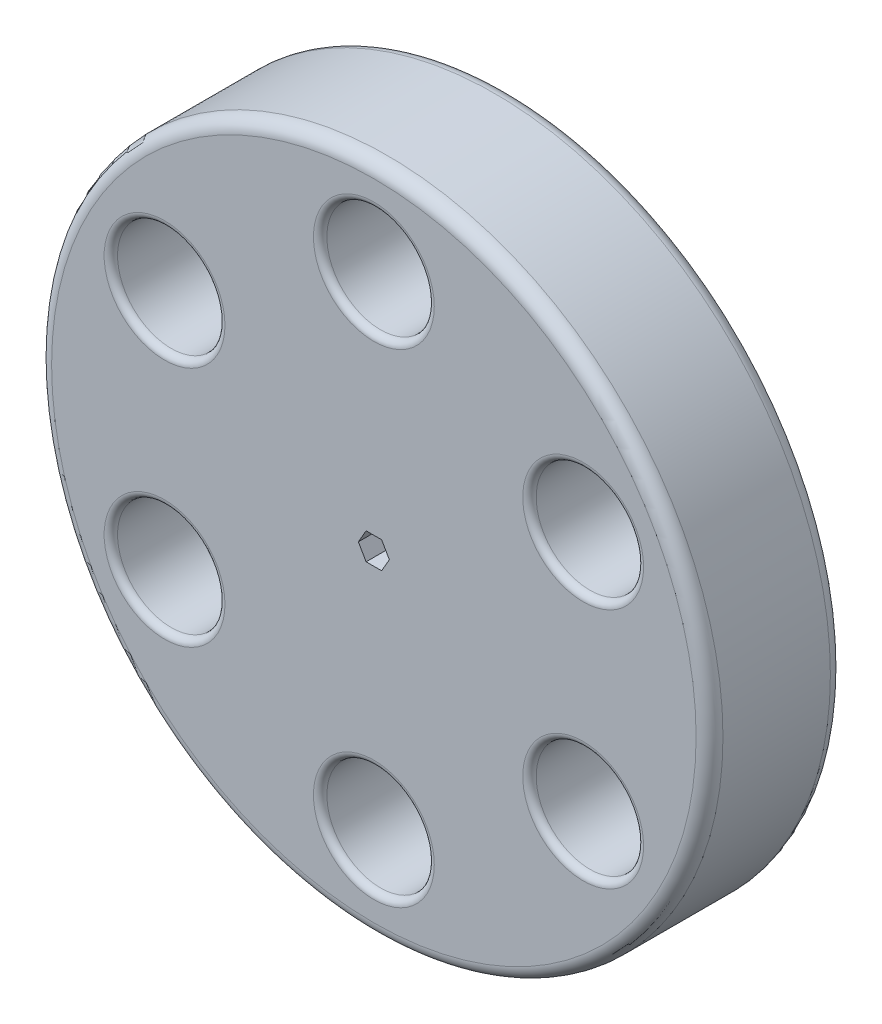
ISO-10303-21;
HEADER;
FILE_DESCRIPTION(('STEP AP214'),'2;1');
FILE_NAME('part.step','',(''),(''),'','','');
FILE_SCHEMA(('AUTOMOTIVE_DESIGN { 1 0 10303 214 1 1 1 1 }'));
ENDSEC;
DATA;
#1=APPLICATION_CONTEXT('core data for automotive mechanical design processes');
#2=APPLICATION_PROTOCOL_DEFINITION('international standard','automotive_design',2000,#1);
#3=PRODUCT_CONTEXT('',#1,'mechanical');
#4=PRODUCT('Part','Part','',(#3));
#5=PRODUCT_RELATED_PRODUCT_CATEGORY('part','',(#4));
#6=PRODUCT_DEFINITION_FORMATION('','',#4);
#7=PRODUCT_DEFINITION_CONTEXT('part definition',#1,'design');
#8=PRODUCT_DEFINITION('design','',#6,#7);
#9=PRODUCT_DEFINITION_SHAPE('','',#8);
#10=(LENGTH_UNIT() NAMED_UNIT(*) SI_UNIT(.MILLI.,.METRE.));
#11=(NAMED_UNIT(*) PLANE_ANGLE_UNIT() SI_UNIT($,.RADIAN.));
#12=(NAMED_UNIT(*) SI_UNIT($,.STERADIAN.) SOLID_ANGLE_UNIT());
#13=UNCERTAINTY_MEASURE_WITH_UNIT(LENGTH_MEASURE(1.E-05),#10,'distance_accuracy_value','');
#14=(GEOMETRIC_REPRESENTATION_CONTEXT(3) GLOBAL_UNCERTAINTY_ASSIGNED_CONTEXT((#13)) GLOBAL_UNIT_ASSIGNED_CONTEXT((#10,
#11,#12)) REPRESENTATION_CONTEXT('',''));
#15=CARTESIAN_POINT('',(0.,0.,0.));
#16=DIRECTION('',(0.,0.,1.));
#17=DIRECTION('',(1.,0.,0.));
#18=AXIS2_PLACEMENT_3D('',#15,#16,#17);
#19=CARTESIAN_POINT('',(0.,0.,10.));
#20=DIRECTION('',(0.,0.,-1.));
#21=DIRECTION('',(-1.,0.,0.));
#22=AXIS2_PLACEMENT_3D('',#19,#20,#21);
#23=CYLINDRICAL_SURFACE('',#22,25.);
#24=CARTESIAN_POINT('',(0.,0.,0.999999999999999));
#25=DIRECTION('',(0.,0.,1.));
#26=DIRECTION('',(1.,0.,0.));
#27=AXIS2_PLACEMENT_3D('',#24,#25,#26);
#28=CIRCLE('',#27,25.);
#29=CARTESIAN_POINT('',(25.,0.,0.999999999999999));
#30=VERTEX_POINT('',#29);
#31=EDGE_CURVE('E135',#30,#30,#28,.T.);
#32=ORIENTED_EDGE('',*,*,#31,.T.);
#33=EDGE_LOOP('',(#32));
#34=FACE_BOUND('',#33,.T.);
#35=CARTESIAN_POINT('',(0.,0.,9.));
#36=DIRECTION('',(0.,0.,1.));
#37=DIRECTION('',(1.,0.,0.));
#38=AXIS2_PLACEMENT_3D('',#35,#36,#37);
#39=CIRCLE('',#38,25.);
#40=CARTESIAN_POINT('',(25.,0.,9.));
#41=VERTEX_POINT('',#40);
#42=EDGE_CURVE('E131',#41,#41,#39,.F.);
#43=ORIENTED_EDGE('',*,*,#42,.T.);
#44=EDGE_LOOP('',(#43));
#45=FACE_BOUND('',#44,.T.);
#46=ADVANCED_FACE('F37',(#34,#45),#23,.T.);
#47=CARTESIAN_POINT('',(0.,0.,10.));
#48=DIRECTION('',(0.,0.,1.));
#49=DIRECTION('',(1.,0.,0.));
#50=AXIS2_PLACEMENT_3D('',#47,#48,#49);
#51=PLANE('',#50);
#52=DIRECTION('',(0.5,0.866025403784439,0.));
#53=VECTOR('',#52,1.);
#54=CARTESIAN_POINT('',(0.577350269189626,-1.,10.));
#55=LINE('',#54,#53);
#56=CARTESIAN_POINT('',(0.577350269189626,-1.,10.));
#57=VERTEX_POINT('',#56);
#58=CARTESIAN_POINT('',(1.15470053837925,0.,10.));
#59=VERTEX_POINT('',#58);
#60=EDGE_CURVE('E52',#57,#59,#55,.T.);
#61=ORIENTED_EDGE('',*,*,#60,.F.);
#62=DIRECTION('',(1.,0.,0.));
#63=VECTOR('',#62,1.);
#64=CARTESIAN_POINT('',(-0.577350269189626,-1.,10.));
#65=LINE('',#64,#63);
#66=CARTESIAN_POINT('',(-0.577350269189626,-1.,10.));
#67=VERTEX_POINT('',#66);
#68=EDGE_CURVE('E118',#67,#57,#65,.T.);
#69=ORIENTED_EDGE('',*,*,#68,.F.);
#70=DIRECTION('',(0.5,-0.866025403784438,0.));
#71=VECTOR('',#70,1.);
#72=CARTESIAN_POINT('',(-1.15470053837925,0.,10.));
#73=LINE('',#72,#71);
#74=CARTESIAN_POINT('',(-1.15470053837925,0.,10.));
#75=VERTEX_POINT('',#74);
#76=EDGE_CURVE('E112',#75,#67,#73,.T.);
#77=ORIENTED_EDGE('',*,*,#76,.F.);
#78=DIRECTION('',(-0.5,-0.866025403784439,0.));
#79=VECTOR('',#78,1.);
#80=CARTESIAN_POINT('',(-0.577350269189626,1.,10.));
#81=LINE('',#80,#79);
#82=CARTESIAN_POINT('',(-0.577350269189626,1.,10.));
#83=VERTEX_POINT('',#82);
#84=EDGE_CURVE('E110',#83,#75,#81,.T.);
#85=ORIENTED_EDGE('',*,*,#84,.F.);
#86=DIRECTION('',(-1.,0.,0.));
#87=VECTOR('',#86,1.);
#88=CARTESIAN_POINT('',(0.577350269189625,1.,10.));
#89=LINE('',#88,#87);
#90=CARTESIAN_POINT('',(0.577350269189625,1.,10.));
#91=VERTEX_POINT('',#90);
#92=EDGE_CURVE('E93',#91,#83,#89,.T.);
#93=ORIENTED_EDGE('',*,*,#92,.F.);
#94=DIRECTION('',(-0.5,0.866025403784439,0.));
#95=VECTOR('',#94,1.);
#96=CARTESIAN_POINT('',(1.15470053837925,0.,10.));
#97=LINE('',#96,#95);
#98=EDGE_CURVE('E102',#59,#91,#97,.T.);
#99=ORIENTED_EDGE('',*,*,#98,.F.);
#100=EDGE_LOOP('',(#61,#69,#77,#85,#93,#99));
#101=FACE_BOUND('',#100,.T.);
#102=CARTESIAN_POINT('',(-15.5884572681199,-9.00000000000007,10.));
#103=DIRECTION('',(0.,0.,1.));
#104=DIRECTION('',(1.,0.,0.));
#105=AXIS2_PLACEMENT_3D('',#102,#103,#104);
#106=CIRCLE('',#105,4.5);
#107=CARTESIAN_POINT('',(-11.0884572681199,-9.00000000000007,10.));
#108=VERTEX_POINT('',#107);
#109=EDGE_CURVE('E165',#108,#108,#106,.F.);
#110=ORIENTED_EDGE('',*,*,#109,.T.);
#111=EDGE_LOOP('',(#110));
#112=FACE_BOUND('',#111,.T.);
#113=CARTESIAN_POINT('',(0.,-18.,10.));
#114=DIRECTION('',(0.,0.,1.));
#115=DIRECTION('',(1.,0.,0.));
#116=AXIS2_PLACEMENT_3D('',#113,#114,#115);
#117=CIRCLE('',#116,4.5);
#118=CARTESIAN_POINT('',(4.5,-18.,10.));
#119=VERTEX_POINT('',#118);
#120=EDGE_CURVE('E162',#119,#119,#117,.F.);
#121=ORIENTED_EDGE('',*,*,#120,.T.);
#122=EDGE_LOOP('',(#121));
#123=FACE_BOUND('',#122,.T.);
#124=CARTESIAN_POINT('',(15.58845726812,-8.99999999999985,10.));
#125=DIRECTION('',(0.,0.,1.));
#126=DIRECTION('',(1.,0.,0.));
#127=AXIS2_PLACEMENT_3D('',#124,#125,#126);
#128=CIRCLE('',#127,4.5);
#129=CARTESIAN_POINT('',(20.08845726812,-8.99999999999985,10.));
#130=VERTEX_POINT('',#129);
#131=EDGE_CURVE('E159',#130,#130,#128,.F.);
#132=ORIENTED_EDGE('',*,*,#131,.T.);
#133=EDGE_LOOP('',(#132));
#134=FACE_BOUND('',#133,.T.);
#135=CARTESIAN_POINT('',(15.5884572681198,9.00000000000018,10.));
#136=DIRECTION('',(0.,0.,1.));
#137=DIRECTION('',(1.,0.,0.));
#138=AXIS2_PLACEMENT_3D('',#135,#136,#137);
#139=CIRCLE('',#138,4.5);
#140=CARTESIAN_POINT('',(20.0884572681198,9.00000000000018,10.));
#141=VERTEX_POINT('',#140);
#142=EDGE_CURVE('E156',#141,#141,#139,.F.);
#143=ORIENTED_EDGE('',*,*,#142,.T.);
#144=EDGE_LOOP('',(#143));
#145=FACE_BOUND('',#144,.T.);
#146=CARTESIAN_POINT('',(0.,18.,10.));
#147=DIRECTION('',(0.,0.,1.));
#148=DIRECTION('',(1.,0.,0.));
#149=AXIS2_PLACEMENT_3D('',#146,#147,#148);
#150=CIRCLE('',#149,4.5);
#151=CARTESIAN_POINT('',(4.5,18.,10.));
#152=VERTEX_POINT('',#151);
#153=EDGE_CURVE('E153',#152,#152,#150,.F.);
#154=ORIENTED_EDGE('',*,*,#153,.T.);
#155=EDGE_LOOP('',(#154));
#156=FACE_BOUND('',#155,.T.);
#157=CARTESIAN_POINT('',(-15.5884572681199,8.99999999999996,10.));
#158=DIRECTION('',(0.,0.,1.));
#159=DIRECTION('',(1.,0.,0.));
#160=AXIS2_PLACEMENT_3D('',#157,#158,#159);
#161=CIRCLE('',#160,4.5);
#162=CARTESIAN_POINT('',(-11.0884572681199,8.99999999999996,10.));
#163=VERTEX_POINT('',#162);
#164=EDGE_CURVE('E150',#163,#163,#161,.F.);
#165=ORIENTED_EDGE('',*,*,#164,.T.);
#166=EDGE_LOOP('',(#165));
#167=FACE_BOUND('',#166,.T.);
#168=CARTESIAN_POINT('',(0.,0.,10.));
#169=DIRECTION('',(0.,0.,1.));
#170=DIRECTION('',(1.,0.,0.));
#171=AXIS2_PLACEMENT_3D('',#168,#169,#170);
#172=CIRCLE('',#171,24.);
#173=CARTESIAN_POINT('',(24.,0.,10.));
#174=VERTEX_POINT('',#173);
#175=EDGE_CURVE('E141',#174,#174,#172,.T.);
#176=ORIENTED_EDGE('',*,*,#175,.T.);
#177=EDGE_LOOP('',(#176));
#178=FACE_BOUND('',#177,.T.);
#179=ADVANCED_FACE('F106',(#101,#112,#123,#134,#145,#156,#167,#178),#51,.T.);
#180=CARTESIAN_POINT('',(0.,0.,0.));
#181=DIRECTION('',(0.,0.,1.));
#182=DIRECTION('',(1.,0.,0.));
#183=AXIS2_PLACEMENT_3D('',#180,#181,#182);
#184=PLANE('',#183);
#185=DIRECTION('',(-1.,0.,0.));
#186=VECTOR('',#185,1.);
#187=CARTESIAN_POINT('',(-0.577350269189626,-1.,0.));
#188=LINE('',#187,#186);
#189=CARTESIAN_POINT('',(0.577350269189626,-1.,0.));
#190=VERTEX_POINT('',#189);
#191=CARTESIAN_POINT('',(-0.577350269189626,-1.,0.));
#192=VERTEX_POINT('',#191);
#193=EDGE_CURVE('E310',#190,#192,#188,.T.);
#194=ORIENTED_EDGE('',*,*,#193,.F.);
#195=DIRECTION('',(-0.5,-0.866025403784439,0.));
#196=VECTOR('',#195,1.);
#197=CARTESIAN_POINT('',(0.577350269189626,-1.,0.));
#198=LINE('',#197,#196);
#199=CARTESIAN_POINT('',(1.15470053837925,0.,0.));
#200=VERTEX_POINT('',#199);
#201=EDGE_CURVE('E132',#200,#190,#198,.T.);
#202=ORIENTED_EDGE('',*,*,#201,.F.);
#203=DIRECTION('',(0.5,-0.866025403784439,0.));
#204=VECTOR('',#203,1.);
#205=CARTESIAN_POINT('',(1.15470053837925,0.,0.));
#206=LINE('',#205,#204);
#207=CARTESIAN_POINT('',(0.577350269189625,1.,0.));
#208=VERTEX_POINT('',#207);
#209=EDGE_CURVE('E129',#208,#200,#206,.T.);
#210=ORIENTED_EDGE('',*,*,#209,.F.);
#211=DIRECTION('',(1.,0.,0.));
#212=VECTOR('',#211,1.);
#213=CARTESIAN_POINT('',(0.577350269189625,1.,0.));
#214=LINE('',#213,#212);
#215=CARTESIAN_POINT('',(-0.577350269189626,1.,0.));
#216=VERTEX_POINT('',#215);
#217=EDGE_CURVE('E96',#216,#208,#214,.T.);
#218=ORIENTED_EDGE('',*,*,#217,.F.);
#219=DIRECTION('',(0.5,0.866025403784439,0.));
#220=VECTOR('',#219,1.);
#221=CARTESIAN_POINT('',(-0.577350269189626,1.,0.));
#222=LINE('',#221,#220);
#223=CARTESIAN_POINT('',(-1.15470053837925,0.,0.));
#224=VERTEX_POINT('',#223);
#225=EDGE_CURVE('E329',#224,#216,#222,.T.);
#226=ORIENTED_EDGE('',*,*,#225,.F.);
#227=DIRECTION('',(-0.5,0.866025403784438,0.));
#228=VECTOR('',#227,1.);
#229=CARTESIAN_POINT('',(-1.15470053837925,0.,0.));
#230=LINE('',#229,#228);
#231=EDGE_CURVE('E323',#192,#224,#230,.T.);
#232=ORIENTED_EDGE('',*,*,#231,.F.);
#233=EDGE_LOOP('',(#194,#202,#210,#218,#226,#232));
#234=FACE_BOUND('',#233,.T.);
#235=CARTESIAN_POINT('',(-15.5884572681199,-9.00000000000007,0.));
#236=DIRECTION('',(0.,0.,1.));
#237=DIRECTION('',(1.,0.,0.));
#238=AXIS2_PLACEMENT_3D('',#235,#236,#237);
#239=CIRCLE('',#238,4.5);
#240=CARTESIAN_POINT('',(-11.0884572681199,-9.00000000000007,0.));
#241=VERTEX_POINT('',#240);
#242=EDGE_CURVE('E183',#241,#241,#239,.T.);
#243=ORIENTED_EDGE('',*,*,#242,.T.);
#244=EDGE_LOOP('',(#243));
#245=FACE_BOUND('',#244,.T.);
#246=CARTESIAN_POINT('',(0.,-18.,0.));
#247=DIRECTION('',(0.,0.,1.));
#248=DIRECTION('',(1.,0.,0.));
#249=AXIS2_PLACEMENT_3D('',#246,#247,#248);
#250=CIRCLE('',#249,4.5);
#251=CARTESIAN_POINT('',(4.5,-18.,0.));
#252=VERTEX_POINT('',#251);
#253=EDGE_CURVE('E180',#252,#252,#250,.T.);
#254=ORIENTED_EDGE('',*,*,#253,.T.);
#255=EDGE_LOOP('',(#254));
#256=FACE_BOUND('',#255,.T.);
#257=CARTESIAN_POINT('',(15.58845726812,-8.99999999999985,0.));
#258=DIRECTION('',(0.,0.,1.));
#259=DIRECTION('',(1.,0.,0.));
#260=AXIS2_PLACEMENT_3D('',#257,#258,#259);
#261=CIRCLE('',#260,4.5);
#262=CARTESIAN_POINT('',(20.08845726812,-8.99999999999985,0.));
#263=VERTEX_POINT('',#262);
#264=EDGE_CURVE('E177',#263,#263,#261,.T.);
#265=ORIENTED_EDGE('',*,*,#264,.T.);
#266=EDGE_LOOP('',(#265));
#267=FACE_BOUND('',#266,.T.);
#268=CARTESIAN_POINT('',(15.5884572681198,9.00000000000018,0.));
#269=DIRECTION('',(0.,0.,1.));
#270=DIRECTION('',(1.,0.,0.));
#271=AXIS2_PLACEMENT_3D('',#268,#269,#270);
#272=CIRCLE('',#271,4.5);
#273=CARTESIAN_POINT('',(20.0884572681198,9.00000000000018,0.));
#274=VERTEX_POINT('',#273);
#275=EDGE_CURVE('E174',#274,#274,#272,.T.);
#276=ORIENTED_EDGE('',*,*,#275,.T.);
#277=EDGE_LOOP('',(#276));
#278=FACE_BOUND('',#277,.T.);
#279=CARTESIAN_POINT('',(0.,18.,0.));
#280=DIRECTION('',(0.,0.,1.));
#281=DIRECTION('',(1.,0.,0.));
#282=AXIS2_PLACEMENT_3D('',#279,#280,#281);
#283=CIRCLE('',#282,4.5);
#284=CARTESIAN_POINT('',(4.5,18.,0.));
#285=VERTEX_POINT('',#284);
#286=EDGE_CURVE('E171',#285,#285,#283,.T.);
#287=ORIENTED_EDGE('',*,*,#286,.T.);
#288=EDGE_LOOP('',(#287));
#289=FACE_BOUND('',#288,.T.);
#290=CARTESIAN_POINT('',(-15.5884572681199,8.99999999999996,0.));
#291=DIRECTION('',(0.,0.,1.));
#292=DIRECTION('',(1.,0.,0.));
#293=AXIS2_PLACEMENT_3D('',#290,#291,#292);
#294=CIRCLE('',#293,4.5);
#295=CARTESIAN_POINT('',(-11.0884572681199,8.99999999999996,0.));
#296=VERTEX_POINT('',#295);
#297=EDGE_CURVE('E168',#296,#296,#294,.T.);
#298=ORIENTED_EDGE('',*,*,#297,.T.);
#299=EDGE_LOOP('',(#298));
#300=FACE_BOUND('',#299,.T.);
#301=CARTESIAN_POINT('',(0.,0.,0.));
#302=DIRECTION('',(0.,0.,1.));
#303=DIRECTION('',(1.,0.,0.));
#304=AXIS2_PLACEMENT_3D('',#301,#302,#303);
#305=CIRCLE('',#304,24.);
#306=CARTESIAN_POINT('',(24.,0.,0.));
#307=VERTEX_POINT('',#306);
#308=EDGE_CURVE('E138',#307,#307,#305,.F.);
#309=ORIENTED_EDGE('',*,*,#308,.T.);
#310=EDGE_LOOP('',(#309));
#311=FACE_BOUND('',#310,.T.);
#312=ADVANCED_FACE('F233',(#234,#245,#256,#267,#278,#289,#300,#311),#184,.F.);
#313=CARTESIAN_POINT('',(0.,18.,0.));
#314=DIRECTION('',(0.,0.,1.));
#315=DIRECTION('',(1.,0.,0.));
#316=AXIS2_PLACEMENT_3D('',#313,#314,#315);
#317=CYLINDRICAL_SURFACE('',#316,4.);
#318=CARTESIAN_POINT('',(0.,18.,9.5));
#319=DIRECTION('',(0.,0.,1.));
#320=DIRECTION('',(1.,0.,0.));
#321=AXIS2_PLACEMENT_3D('',#318,#319,#320);
#322=CIRCLE('',#321,4.);
#323=CARTESIAN_POINT('',(4.,18.,9.5));
#324=VERTEX_POINT('',#323);
#325=EDGE_CURVE('E207',#324,#324,#322,.T.);
#326=ORIENTED_EDGE('',*,*,#325,.T.);
#327=EDGE_LOOP('',(#326));
#328=FACE_BOUND('',#327,.T.);
#329=CARTESIAN_POINT('',(0.,18.,0.5));
#330=DIRECTION('',(0.,0.,1.));
#331=DIRECTION('',(1.,0.,0.));
#332=AXIS2_PLACEMENT_3D('',#329,#330,#331);
#333=CIRCLE('',#332,4.);
#334=CARTESIAN_POINT('',(4.,18.,0.5));
#335=VERTEX_POINT('',#334);
#336=EDGE_CURVE('E204',#335,#335,#333,.F.);
#337=ORIENTED_EDGE('',*,*,#336,.T.);
#338=EDGE_LOOP('',(#337));
#339=FACE_BOUND('',#338,.T.);
#340=ADVANCED_FACE('F293',(#328,#339),#317,.F.);
#341=CARTESIAN_POINT('',(-15.5884572681199,8.99999999999996,0.));
#342=DIRECTION('',(0.,0.,1.));
#343=DIRECTION('',(1.,0.,0.));
#344=AXIS2_PLACEMENT_3D('',#341,#342,#343);
#345=CYLINDRICAL_SURFACE('',#344,4.);
#346=CARTESIAN_POINT('',(-15.5884572681199,8.99999999999996,0.5));
#347=DIRECTION('',(0.,0.,1.));
#348=DIRECTION('',(1.,0.,0.));
#349=AXIS2_PLACEMENT_3D('',#346,#347,#348);
#350=CIRCLE('',#349,4.);
#351=CARTESIAN_POINT('',(-11.5884572681199,8.99999999999996,0.5));
#352=VERTEX_POINT('',#351);
#353=EDGE_CURVE('E11',#352,#352,#350,.F.);
#354=ORIENTED_EDGE('',*,*,#353,.T.);
#355=EDGE_LOOP('',(#354));
#356=FACE_BOUND('',#355,.T.);
#357=CARTESIAN_POINT('',(-15.5884572681199,8.99999999999996,9.5));
#358=DIRECTION('',(0.,0.,1.));
#359=DIRECTION('',(1.,0.,0.));
#360=AXIS2_PLACEMENT_3D('',#357,#358,#359);
#361=CIRCLE('',#360,4.);
#362=CARTESIAN_POINT('',(-11.5884572681199,8.99999999999996,9.5));
#363=VERTEX_POINT('',#362);
#364=EDGE_CURVE('E45',#363,#363,#361,.T.);
#365=ORIENTED_EDGE('',*,*,#364,.T.);
#366=EDGE_LOOP('',(#365));
#367=FACE_BOUND('',#366,.T.);
#368=ADVANCED_FACE('F212',(#356,#367),#345,.F.);
#369=CARTESIAN_POINT('',(-15.5884572681199,-9.00000000000007,0.));
#370=DIRECTION('',(0.,0.,1.));
#371=DIRECTION('',(1.,0.,0.));
#372=AXIS2_PLACEMENT_3D('',#369,#370,#371);
#373=CYLINDRICAL_SURFACE('',#372,4.);
#374=CARTESIAN_POINT('',(-15.5884572681199,-9.00000000000007,9.5));
#375=DIRECTION('',(0.,0.,1.));
#376=DIRECTION('',(1.,0.,0.));
#377=AXIS2_PLACEMENT_3D('',#374,#375,#376);
#378=CIRCLE('',#377,4.);
#379=CARTESIAN_POINT('',(-11.5884572681199,-9.00000000000007,9.5));
#380=VERTEX_POINT('',#379);
#381=EDGE_CURVE('E147',#380,#380,#378,.T.);
#382=ORIENTED_EDGE('',*,*,#381,.T.);
#383=EDGE_LOOP('',(#382));
#384=FACE_BOUND('',#383,.T.);
#385=CARTESIAN_POINT('',(-15.5884572681199,-9.00000000000007,0.5));
#386=DIRECTION('',(0.,0.,1.));
#387=DIRECTION('',(1.,0.,0.));
#388=AXIS2_PLACEMENT_3D('',#385,#386,#387);
#389=CIRCLE('',#388,4.);
#390=CARTESIAN_POINT('',(-11.5884572681199,-9.00000000000007,0.5));
#391=VERTEX_POINT('',#390);
#392=EDGE_CURVE('E144',#391,#391,#389,.F.);
#393=ORIENTED_EDGE('',*,*,#392,.T.);
#394=EDGE_LOOP('',(#393));
#395=FACE_BOUND('',#394,.T.);
#396=ADVANCED_FACE('F352',(#384,#395),#373,.F.);
#397=CARTESIAN_POINT('',(0.,-18.,0.));
#398=DIRECTION('',(0.,0.,1.));
#399=DIRECTION('',(1.,0.,0.));
#400=AXIS2_PLACEMENT_3D('',#397,#398,#399);
#401=CYLINDRICAL_SURFACE('',#400,4.);
#402=CARTESIAN_POINT('',(0.,-18.,0.5));
#403=DIRECTION('',(0.,0.,1.));
#404=DIRECTION('',(1.,0.,0.));
#405=AXIS2_PLACEMENT_3D('',#402,#403,#404);
#406=CIRCLE('',#405,4.);
#407=CARTESIAN_POINT('',(4.,-18.,0.5));
#408=VERTEX_POINT('',#407);
#409=EDGE_CURVE('E189',#408,#408,#406,.F.);
#410=ORIENTED_EDGE('',*,*,#409,.T.);
#411=EDGE_LOOP('',(#410));
#412=FACE_BOUND('',#411,.T.);
#413=CARTESIAN_POINT('',(0.,-18.,9.5));
#414=DIRECTION('',(0.,0.,1.));
#415=DIRECTION('',(1.,0.,0.));
#416=AXIS2_PLACEMENT_3D('',#413,#414,#415);
#417=CIRCLE('',#416,4.);
#418=CARTESIAN_POINT('',(4.,-18.,9.5));
#419=VERTEX_POINT('',#418);
#420=EDGE_CURVE('E186',#419,#419,#417,.T.);
#421=ORIENTED_EDGE('',*,*,#420,.T.);
#422=EDGE_LOOP('',(#421));
#423=FACE_BOUND('',#422,.T.);
#424=ADVANCED_FACE('F355',(#412,#423),#401,.F.);
#425=CARTESIAN_POINT('',(15.58845726812,-8.99999999999985,0.));
#426=DIRECTION('',(0.,0.,1.));
#427=DIRECTION('',(1.,0.,0.));
#428=AXIS2_PLACEMENT_3D('',#425,#426,#427);
#429=CYLINDRICAL_SURFACE('',#428,4.);
#430=CARTESIAN_POINT('',(15.58845726812,-8.99999999999985,9.5));
#431=DIRECTION('',(0.,0.,1.));
#432=DIRECTION('',(1.,0.,0.));
#433=AXIS2_PLACEMENT_3D('',#430,#431,#432);
#434=CIRCLE('',#433,4.);
#435=CARTESIAN_POINT('',(19.58845726812,-8.99999999999985,9.5));
#436=VERTEX_POINT('',#435);
#437=EDGE_CURVE('E195',#436,#436,#434,.T.);
#438=ORIENTED_EDGE('',*,*,#437,.T.);
#439=EDGE_LOOP('',(#438));
#440=FACE_BOUND('',#439,.T.);
#441=CARTESIAN_POINT('',(15.58845726812,-8.99999999999985,0.5));
#442=DIRECTION('',(0.,0.,1.));
#443=DIRECTION('',(1.,0.,0.));
#444=AXIS2_PLACEMENT_3D('',#441,#442,#443);
#445=CIRCLE('',#444,4.);
#446=CARTESIAN_POINT('',(19.58845726812,-8.99999999999985,0.5));
#447=VERTEX_POINT('',#446);
#448=EDGE_CURVE('E192',#447,#447,#445,.F.);
#449=ORIENTED_EDGE('',*,*,#448,.T.);
#450=EDGE_LOOP('',(#449));
#451=FACE_BOUND('',#450,.T.);
#452=ADVANCED_FACE('F359',(#440,#451),#429,.F.);
#453=CARTESIAN_POINT('',(15.5884572681198,9.00000000000018,0.));
#454=DIRECTION('',(0.,0.,1.));
#455=DIRECTION('',(1.,0.,0.));
#456=AXIS2_PLACEMENT_3D('',#453,#454,#455);
#457=CYLINDRICAL_SURFACE('',#456,4.);
#458=CARTESIAN_POINT('',(15.5884572681198,9.00000000000018,0.5));
#459=DIRECTION('',(0.,0.,1.));
#460=DIRECTION('',(1.,0.,0.));
#461=AXIS2_PLACEMENT_3D('',#458,#459,#460);
#462=CIRCLE('',#461,4.);
#463=CARTESIAN_POINT('',(19.5884572681198,9.00000000000018,0.5));
#464=VERTEX_POINT('',#463);
#465=EDGE_CURVE('E201',#464,#464,#462,.F.);
#466=ORIENTED_EDGE('',*,*,#465,.T.);
#467=EDGE_LOOP('',(#466));
#468=FACE_BOUND('',#467,.T.);
#469=CARTESIAN_POINT('',(15.5884572681198,9.00000000000018,9.5));
#470=DIRECTION('',(0.,0.,1.));
#471=DIRECTION('',(1.,0.,0.));
#472=AXIS2_PLACEMENT_3D('',#469,#470,#471);
#473=CIRCLE('',#472,4.);
#474=CARTESIAN_POINT('',(19.5884572681198,9.00000000000018,9.5));
#475=VERTEX_POINT('',#474);
#476=EDGE_CURVE('E198',#475,#475,#473,.T.);
#477=ORIENTED_EDGE('',*,*,#476,.T.);
#478=EDGE_LOOP('',(#477));
#479=FACE_BOUND('',#478,.T.);
#480=ADVANCED_FACE('F242',(#468,#479),#457,.F.);
#481=CARTESIAN_POINT('',(0.,0.,0.999999999999999));
#482=DIRECTION('',(0.,0.,1.));
#483=DIRECTION('',(1.,0.,0.));
#484=AXIS2_PLACEMENT_3D('',#481,#482,#483);
#485=TOROIDAL_SURFACE('',#484,24.,1.);
#486=ORIENTED_EDGE('',*,*,#308,.F.);
#487=EDGE_LOOP('',(#486));
#488=FACE_BOUND('',#487,.T.);
#489=ORIENTED_EDGE('',*,*,#31,.F.);
#490=EDGE_LOOP('',(#489));
#491=FACE_BOUND('',#490,.T.);
#492=ADVANCED_FACE('F238',(#488,#491),#485,.T.);
#493=CARTESIAN_POINT('',(0.,0.,9.));
#494=DIRECTION('',(0.,0.,1.));
#495=DIRECTION('',(1.,0.,0.));
#496=AXIS2_PLACEMENT_3D('',#493,#494,#495);
#497=TOROIDAL_SURFACE('',#496,24.,1.);
#498=ORIENTED_EDGE('',*,*,#42,.F.);
#499=EDGE_LOOP('',(#498));
#500=FACE_BOUND('',#499,.T.);
#501=ORIENTED_EDGE('',*,*,#175,.F.);
#502=EDGE_LOOP('',(#501));
#503=FACE_BOUND('',#502,.T.);
#504=ADVANCED_FACE('F241',(#500,#503),#497,.T.);
#505=CARTESIAN_POINT('',(-15.5884572681199,-9.00000000000007,9.5));
#506=DIRECTION('',(0.,0.,1.));
#507=DIRECTION('',(1.,0.,0.));
#508=AXIS2_PLACEMENT_3D('',#505,#506,#507);
#509=TOROIDAL_SURFACE('',#508,4.5,0.5);
#510=ORIENTED_EDGE('',*,*,#109,.F.);
#511=EDGE_LOOP('',(#510));
#512=FACE_BOUND('',#511,.T.);
#513=ORIENTED_EDGE('',*,*,#381,.F.);
#514=EDGE_LOOP('',(#513));
#515=FACE_BOUND('',#514,.T.);
#516=ADVANCED_FACE('F246',(#512,#515),#509,.T.);
#517=CARTESIAN_POINT('',(-15.5884572681199,-9.00000000000007,0.5));
#518=DIRECTION('',(0.,0.,1.));
#519=DIRECTION('',(1.,0.,0.));
#520=AXIS2_PLACEMENT_3D('',#517,#518,#519);
#521=TOROIDAL_SURFACE('',#520,4.5,0.5);
#522=ORIENTED_EDGE('',*,*,#392,.F.);
#523=EDGE_LOOP('',(#522));
#524=FACE_BOUND('',#523,.T.);
#525=ORIENTED_EDGE('',*,*,#242,.F.);
#526=EDGE_LOOP('',(#525));
#527=FACE_BOUND('',#526,.T.);
#528=ADVANCED_FACE('F250',(#524,#527),#521,.T.);
#529=CARTESIAN_POINT('',(0.,-18.,0.5));
#530=DIRECTION('',(0.,0.,1.));
#531=DIRECTION('',(1.,0.,0.));
#532=AXIS2_PLACEMENT_3D('',#529,#530,#531);
#533=TOROIDAL_SURFACE('',#532,4.5,0.5);
#534=ORIENTED_EDGE('',*,*,#409,.F.);
#535=EDGE_LOOP('',(#534));
#536=FACE_BOUND('',#535,.T.);
#537=ORIENTED_EDGE('',*,*,#253,.F.);
#538=EDGE_LOOP('',(#537));
#539=FACE_BOUND('',#538,.T.);
#540=ADVANCED_FACE('F254',(#536,#539),#533,.T.);
#541=CARTESIAN_POINT('',(0.,-18.,9.5));
#542=DIRECTION('',(0.,0.,1.));
#543=DIRECTION('',(1.,0.,0.));
#544=AXIS2_PLACEMENT_3D('',#541,#542,#543);
#545=TOROIDAL_SURFACE('',#544,4.5,0.5);
#546=ORIENTED_EDGE('',*,*,#120,.F.);
#547=EDGE_LOOP('',(#546));
#548=FACE_BOUND('',#547,.T.);
#549=ORIENTED_EDGE('',*,*,#420,.F.);
#550=EDGE_LOOP('',(#549));
#551=FACE_BOUND('',#550,.T.);
#552=ADVANCED_FACE('F258',(#548,#551),#545,.T.);
#553=CARTESIAN_POINT('',(15.58845726812,-8.99999999999985,9.5));
#554=DIRECTION('',(0.,0.,1.));
#555=DIRECTION('',(1.,0.,0.));
#556=AXIS2_PLACEMENT_3D('',#553,#554,#555);
#557=TOROIDAL_SURFACE('',#556,4.5,0.5);
#558=ORIENTED_EDGE('',*,*,#131,.F.);
#559=EDGE_LOOP('',(#558));
#560=FACE_BOUND('',#559,.T.);
#561=ORIENTED_EDGE('',*,*,#437,.F.);
#562=EDGE_LOOP('',(#561));
#563=FACE_BOUND('',#562,.T.);
#564=ADVANCED_FACE('F262',(#560,#563),#557,.T.);
#565=CARTESIAN_POINT('',(15.58845726812,-8.99999999999985,0.5));
#566=DIRECTION('',(0.,0.,1.));
#567=DIRECTION('',(1.,0.,0.));
#568=AXIS2_PLACEMENT_3D('',#565,#566,#567);
#569=TOROIDAL_SURFACE('',#568,4.5,0.5);
#570=ORIENTED_EDGE('',*,*,#448,.F.);
#571=EDGE_LOOP('',(#570));
#572=FACE_BOUND('',#571,.T.);
#573=ORIENTED_EDGE('',*,*,#264,.F.);
#574=EDGE_LOOP('',(#573));
#575=FACE_BOUND('',#574,.T.);
#576=ADVANCED_FACE('F266',(#572,#575),#569,.T.);
#577=CARTESIAN_POINT('',(15.5884572681198,9.00000000000018,0.5));
#578=DIRECTION('',(0.,0.,1.));
#579=DIRECTION('',(1.,0.,0.));
#580=AXIS2_PLACEMENT_3D('',#577,#578,#579);
#581=TOROIDAL_SURFACE('',#580,4.5,0.5);
#582=ORIENTED_EDGE('',*,*,#465,.F.);
#583=EDGE_LOOP('',(#582));
#584=FACE_BOUND('',#583,.T.);
#585=ORIENTED_EDGE('',*,*,#275,.F.);
#586=EDGE_LOOP('',(#585));
#587=FACE_BOUND('',#586,.T.);
#588=ADVANCED_FACE('F270',(#584,#587),#581,.T.);
#589=CARTESIAN_POINT('',(15.5884572681198,9.00000000000018,9.5));
#590=DIRECTION('',(0.,0.,1.));
#591=DIRECTION('',(1.,0.,0.));
#592=AXIS2_PLACEMENT_3D('',#589,#590,#591);
#593=TOROIDAL_SURFACE('',#592,4.5,0.5);
#594=ORIENTED_EDGE('',*,*,#142,.F.);
#595=EDGE_LOOP('',(#594));
#596=FACE_BOUND('',#595,.T.);
#597=ORIENTED_EDGE('',*,*,#476,.F.);
#598=EDGE_LOOP('',(#597));
#599=FACE_BOUND('',#598,.T.);
#600=ADVANCED_FACE('F274',(#596,#599),#593,.T.);
#601=CARTESIAN_POINT('',(0.,18.,9.5));
#602=DIRECTION('',(0.,0.,1.));
#603=DIRECTION('',(1.,0.,0.));
#604=AXIS2_PLACEMENT_3D('',#601,#602,#603);
#605=TOROIDAL_SURFACE('',#604,4.5,0.5);
#606=ORIENTED_EDGE('',*,*,#153,.F.);
#607=EDGE_LOOP('',(#606));
#608=FACE_BOUND('',#607,.T.);
#609=ORIENTED_EDGE('',*,*,#325,.F.);
#610=EDGE_LOOP('',(#609));
#611=FACE_BOUND('',#610,.T.);
#612=ADVANCED_FACE('F278',(#608,#611),#605,.T.);
#613=CARTESIAN_POINT('',(0.,18.,0.5));
#614=DIRECTION('',(0.,0.,1.));
#615=DIRECTION('',(1.,0.,0.));
#616=AXIS2_PLACEMENT_3D('',#613,#614,#615);
#617=TOROIDAL_SURFACE('',#616,4.5,0.5);
#618=ORIENTED_EDGE('',*,*,#336,.F.);
#619=EDGE_LOOP('',(#618));
#620=FACE_BOUND('',#619,.T.);
#621=ORIENTED_EDGE('',*,*,#286,.F.);
#622=EDGE_LOOP('',(#621));
#623=FACE_BOUND('',#622,.T.);
#624=ADVANCED_FACE('F224',(#620,#623),#617,.T.);
#625=CARTESIAN_POINT('',(-15.5884572681199,8.99999999999996,0.5));
#626=DIRECTION('',(0.,0.,1.));
#627=DIRECTION('',(1.,0.,0.));
#628=AXIS2_PLACEMENT_3D('',#625,#626,#627);
#629=TOROIDAL_SURFACE('',#628,4.5,0.5);
#630=ORIENTED_EDGE('',*,*,#353,.F.);
#631=EDGE_LOOP('',(#630));
#632=FACE_BOUND('',#631,.T.);
#633=ORIENTED_EDGE('',*,*,#297,.F.);
#634=EDGE_LOOP('',(#633));
#635=FACE_BOUND('',#634,.T.);
#636=ADVANCED_FACE('F216',(#632,#635),#629,.T.);
#637=CARTESIAN_POINT('',(-15.5884572681199,8.99999999999996,9.5));
#638=DIRECTION('',(0.,0.,1.));
#639=DIRECTION('',(1.,0.,0.));
#640=AXIS2_PLACEMENT_3D('',#637,#638,#639);
#641=TOROIDAL_SURFACE('',#640,4.5,0.5);
#642=ORIENTED_EDGE('',*,*,#164,.F.);
#643=EDGE_LOOP('',(#642));
#644=FACE_BOUND('',#643,.T.);
#645=ORIENTED_EDGE('',*,*,#364,.F.);
#646=EDGE_LOOP('',(#645));
#647=FACE_BOUND('',#646,.T.);
#648=ADVANCED_FACE('F39',(#644,#647),#641,.T.);
#649=CARTESIAN_POINT('',(0.577350269189626,-1.,-3.0550504633039));
#650=DIRECTION('',(0.866025403784439,-0.5,0.));
#651=DIRECTION('',(0.5,0.866025403784439,0.));
#652=AXIS2_PLACEMENT_3D('',#649,#650,#651);
#653=PLANE('',#652);
#654=ORIENTED_EDGE('',*,*,#201,.T.);
#655=DIRECTION('',(0.,0.,1.));
#656=VECTOR('',#655,1.);
#657=CARTESIAN_POINT('',(0.577350269189626,-1.,-3.0550504633039));
#658=LINE('',#657,#656);
#659=EDGE_CURVE('E121',#190,#57,#658,.T.);
#660=ORIENTED_EDGE('',*,*,#659,.T.);
#661=ORIENTED_EDGE('',*,*,#60,.T.);
#662=DIRECTION('',(0.,0.,1.));
#663=VECTOR('',#662,1.);
#664=CARTESIAN_POINT('',(1.15470053837925,0.,-3.0550504633039));
#665=LINE('',#664,#663);
#666=EDGE_CURVE('E99',#200,#59,#665,.T.);
#667=ORIENTED_EDGE('',*,*,#666,.F.);
#668=EDGE_LOOP('',(#654,#660,#661,#667));
#669=FACE_BOUND('',#668,.T.);
#670=ADVANCED_FACE('F215',(#669),#653,.F.);
#671=CARTESIAN_POINT('',(-0.577350269189626,-1.,-3.0550504633039));
#672=DIRECTION('',(0.,-1.,0.));
#673=DIRECTION('',(0.,0.,-1.));
#674=AXIS2_PLACEMENT_3D('',#671,#672,#673);
#675=PLANE('',#674);
#676=ORIENTED_EDGE('',*,*,#193,.T.);
#677=DIRECTION('',(0.,0.,1.));
#678=VECTOR('',#677,1.);
#679=CARTESIAN_POINT('',(-0.577350269189626,-1.,-3.0550504633039));
#680=LINE('',#679,#678);
#681=EDGE_CURVE('E123',#192,#67,#680,.T.);
#682=ORIENTED_EDGE('',*,*,#681,.T.);
#683=ORIENTED_EDGE('',*,*,#68,.T.);
#684=ORIENTED_EDGE('',*,*,#659,.F.);
#685=EDGE_LOOP('',(#676,#682,#683,#684));
#686=FACE_BOUND('',#685,.T.);
#687=ADVANCED_FACE('F222',(#686),#675,.F.);
#688=CARTESIAN_POINT('',(-1.15470053837925,0.,-3.0550504633039));
#689=DIRECTION('',(-0.866025403784439,-0.5,0.));
#690=DIRECTION('',(0.5,-0.866025403784438,0.));
#691=AXIS2_PLACEMENT_3D('',#688,#689,#690);
#692=PLANE('',#691);
#693=ORIENTED_EDGE('',*,*,#231,.T.);
#694=DIRECTION('',(0.,0.,1.));
#695=VECTOR('',#694,1.);
#696=CARTESIAN_POINT('',(-1.15470053837925,0.,-3.0550504633039));
#697=LINE('',#696,#695);
#698=EDGE_CURVE('E125',#224,#75,#697,.T.);
#699=ORIENTED_EDGE('',*,*,#698,.T.);
#700=ORIENTED_EDGE('',*,*,#76,.T.);
#701=ORIENTED_EDGE('',*,*,#681,.F.);
#702=EDGE_LOOP('',(#693,#699,#700,#701));
#703=FACE_BOUND('',#702,.T.);
#704=ADVANCED_FACE('F338',(#703),#692,.F.);
#705=CARTESIAN_POINT('',(-0.577350269189626,1.,-3.0550504633039));
#706=DIRECTION('',(-0.866025403784439,0.5,0.));
#707=DIRECTION('',(-0.5,-0.866025403784439,0.));
#708=AXIS2_PLACEMENT_3D('',#705,#706,#707);
#709=PLANE('',#708);
#710=ORIENTED_EDGE('',*,*,#225,.T.);
#711=DIRECTION('',(0.,0.,1.));
#712=VECTOR('',#711,1.);
#713=CARTESIAN_POINT('',(-0.577350269189626,1.,-3.0550504633039));
#714=LINE('',#713,#712);
#715=EDGE_CURVE('E98',#216,#83,#714,.T.);
#716=ORIENTED_EDGE('',*,*,#715,.T.);
#717=ORIENTED_EDGE('',*,*,#84,.T.);
#718=ORIENTED_EDGE('',*,*,#698,.F.);
#719=EDGE_LOOP('',(#710,#716,#717,#718));
#720=FACE_BOUND('',#719,.T.);
#721=ADVANCED_FACE('F335',(#720),#709,.F.);
#722=CARTESIAN_POINT('',(0.577350269189625,1.,-3.0550504633039));
#723=DIRECTION('',(0.,1.,0.));
#724=DIRECTION('',(0.,0.,1.));
#725=AXIS2_PLACEMENT_3D('',#722,#723,#724);
#726=PLANE('',#725);
#727=ORIENTED_EDGE('',*,*,#217,.T.);
#728=DIRECTION('',(0.,0.,1.));
#729=VECTOR('',#728,1.);
#730=CARTESIAN_POINT('',(0.577350269189625,1.,-3.0550504633039));
#731=LINE('',#730,#729);
#732=EDGE_CURVE('E60',#208,#91,#731,.T.);
#733=ORIENTED_EDGE('',*,*,#732,.T.);
#734=ORIENTED_EDGE('',*,*,#92,.T.);
#735=ORIENTED_EDGE('',*,*,#715,.F.);
#736=EDGE_LOOP('',(#727,#733,#734,#735));
#737=FACE_BOUND('',#736,.T.);
#738=ADVANCED_FACE('F90',(#737),#726,.F.);
#739=CARTESIAN_POINT('',(1.15470053837925,0.,-3.0550504633039));
#740=DIRECTION('',(0.866025403784438,0.5,0.));
#741=DIRECTION('',(-0.5,0.866025403784439,0.));
#742=AXIS2_PLACEMENT_3D('',#739,#740,#741);
#743=PLANE('',#742);
#744=ORIENTED_EDGE('',*,*,#209,.T.);
#745=ORIENTED_EDGE('',*,*,#666,.T.);
#746=ORIENTED_EDGE('',*,*,#98,.T.);
#747=ORIENTED_EDGE('',*,*,#732,.F.);
#748=EDGE_LOOP('',(#744,#745,#746,#747));
#749=FACE_BOUND('',#748,.T.);
#750=ADVANCED_FACE('F103',(#749),#743,.F.);
#751=CLOSED_SHELL('',(#46,#179,#312,#340,#368,#396,#424,#452,#480,#492,#504,#516,#528,#540,#552,
#564,#576,#588,#600,#612,#624,#636,#648,#670,#687,#704,#721,#738,#750));
#752=MANIFOLD_SOLID_BREP('B2',#751);
#753=ADVANCED_BREP_SHAPE_REPRESENTATION('',(#18,#752),#14);
#754=SHAPE_DEFINITION_REPRESENTATION(#9,#753);
ENDSEC;
END-ISO-10303-21;
